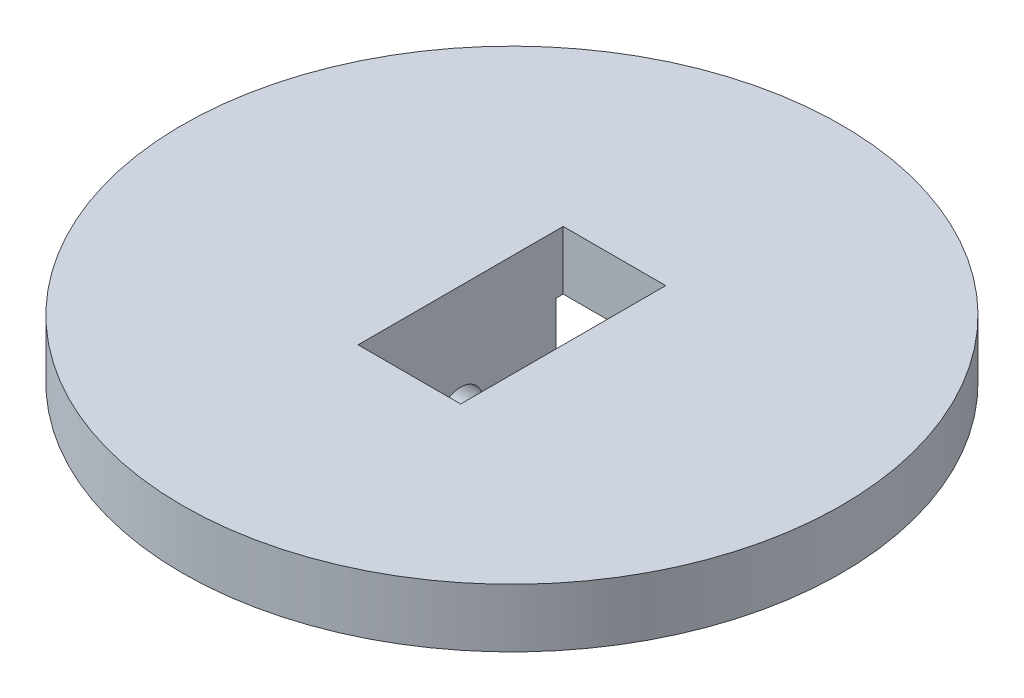
ISO-10303-21;
HEADER;
FILE_DESCRIPTION(('STEP AP214'),'2;1');
FILE_NAME('part.step','',(''),(''),'','','');
FILE_SCHEMA(('AUTOMOTIVE_DESIGN { 1 0 10303 214 1 1 1 1 }'));
ENDSEC;
DATA;
#1=APPLICATION_CONTEXT('core data for automotive mechanical design processes');
#2=APPLICATION_PROTOCOL_DEFINITION('international standard','automotive_design',2000,#1);
#3=PRODUCT_CONTEXT('',#1,'mechanical');
#4=PRODUCT('Part','Part','',(#3));
#5=PRODUCT_RELATED_PRODUCT_CATEGORY('part','',(#4));
#6=PRODUCT_DEFINITION_FORMATION('','',#4);
#7=PRODUCT_DEFINITION_CONTEXT('part definition',#1,'design');
#8=PRODUCT_DEFINITION('design','',#6,#7);
#9=PRODUCT_DEFINITION_SHAPE('','',#8);
#10=(LENGTH_UNIT() NAMED_UNIT(*) SI_UNIT(.MILLI.,.METRE.));
#11=(NAMED_UNIT(*) PLANE_ANGLE_UNIT() SI_UNIT($,.RADIAN.));
#12=(NAMED_UNIT(*) SI_UNIT($,.STERADIAN.) SOLID_ANGLE_UNIT());
#13=UNCERTAINTY_MEASURE_WITH_UNIT(LENGTH_MEASURE(1.E-05),#10,'distance_accuracy_value','');
#14=(GEOMETRIC_REPRESENTATION_CONTEXT(3) GLOBAL_UNCERTAINTY_ASSIGNED_CONTEXT((#13)) GLOBAL_UNIT_ASSIGNED_CONTEXT((#10,
#11,#12)) REPRESENTATION_CONTEXT('',''));
#15=CARTESIAN_POINT('',(0.,0.,0.));
#16=DIRECTION('',(0.,0.,1.));
#17=DIRECTION('',(1.,0.,0.));
#18=AXIS2_PLACEMENT_3D('',#15,#16,#17);
#19=CARTESIAN_POINT('',(0.,0.,6.5));
#20=DIRECTION('',(0.,0.,1.));
#21=DIRECTION('',(1.,0.,0.));
#22=AXIS2_PLACEMENT_3D('',#19,#20,#21);
#23=PLANE('',#22);
#24=DIRECTION('',(0.,-1.,0.));
#25=VECTOR('',#24,1.);
#26=CARTESIAN_POINT('',(-3.5,0.,6.5));
#27=LINE('',#26,#25);
#28=CARTESIAN_POINT('',(-3.5,0.,6.5));
#29=VERTEX_POINT('',#28);
#30=CARTESIAN_POINT('',(-3.5,-7.,6.5));
#31=VERTEX_POINT('',#30);
#32=EDGE_CURVE('E166',#29,#31,#27,.T.);
#33=ORIENTED_EDGE('',*,*,#32,.F.);
#34=DIRECTION('',(1.,0.,0.));
#35=VECTOR('',#34,1.);
#36=CARTESIAN_POINT('',(0.,0.,6.5));
#37=LINE('',#36,#35);
#38=CARTESIAN_POINT('',(-7.,0.,6.5));
#39=VERTEX_POINT('',#38);
#40=EDGE_CURVE('E210',#39,#29,#37,.T.);
#41=ORIENTED_EDGE('',*,*,#40,.F.);
#42=DIRECTION('',(0.,-1.,0.));
#43=VECTOR('',#42,1.);
#44=CARTESIAN_POINT('',(-7.,4.,6.5));
#45=LINE('',#44,#43);
#46=CARTESIAN_POINT('',(-7.,-7.,6.5));
#47=VERTEX_POINT('',#46);
#48=EDGE_CURVE('E169',#39,#47,#45,.T.);
#49=ORIENTED_EDGE('',*,*,#48,.T.);
#50=DIRECTION('',(1.,0.,0.));
#51=VECTOR('',#50,1.);
#52=CARTESIAN_POINT('',(-7.,-7.,6.5));
#53=LINE('',#52,#51);
#54=EDGE_CURVE('E173',#47,#31,#53,.T.);
#55=ORIENTED_EDGE('',*,*,#54,.T.);
#56=EDGE_LOOP('',(#33,#41,#49,#55));
#57=FACE_BOUND('',#56,.T.);
#58=ADVANCED_FACE('F33',(#57),#23,.T.);
#59=CARTESIAN_POINT('',(0.,0.,-6.5));
#60=DIRECTION('',(0.,0.,1.));
#61=DIRECTION('',(1.,0.,0.));
#62=AXIS2_PLACEMENT_3D('',#59,#60,#61);
#63=PLANE('',#62);
#64=DIRECTION('',(1.,0.,0.));
#65=VECTOR('',#64,1.);
#66=CARTESIAN_POINT('',(0.,0.,-6.5));
#67=LINE('',#66,#65);
#68=CARTESIAN_POINT('',(-7.,0.,-6.5));
#69=VERTEX_POINT('',#68);
#70=CARTESIAN_POINT('',(-3.5,0.,-6.5));
#71=VERTEX_POINT('',#70);
#72=EDGE_CURVE('E200',#69,#71,#67,.T.);
#73=ORIENTED_EDGE('',*,*,#72,.T.);
#74=DIRECTION('',(0.,-1.,0.));
#75=VECTOR('',#74,1.);
#76=CARTESIAN_POINT('',(-3.5,0.,-6.5));
#77=LINE('',#76,#75);
#78=CARTESIAN_POINT('',(-3.5,-7.,-6.5));
#79=VERTEX_POINT('',#78);
#80=EDGE_CURVE('E160',#71,#79,#77,.T.);
#81=ORIENTED_EDGE('',*,*,#80,.T.);
#82=DIRECTION('',(1.,0.,0.));
#83=VECTOR('',#82,1.);
#84=CARTESIAN_POINT('',(-7.,-7.,-6.5));
#85=LINE('',#84,#83);
#86=CARTESIAN_POINT('',(-7.,-7.,-6.5));
#87=VERTEX_POINT('',#86);
#88=EDGE_CURVE('E183',#87,#79,#85,.T.);
#89=ORIENTED_EDGE('',*,*,#88,.F.);
#90=DIRECTION('',(0.,-1.,0.));
#91=VECTOR('',#90,1.);
#92=CARTESIAN_POINT('',(-7.,4.,-6.5));
#93=LINE('',#92,#91);
#94=EDGE_CURVE('E180',#69,#87,#93,.T.);
#95=ORIENTED_EDGE('',*,*,#94,.F.);
#96=EDGE_LOOP('',(#73,#81,#89,#95));
#97=FACE_BOUND('',#96,.T.);
#98=ADVANCED_FACE('F235',(#97),#63,.F.);
#99=CARTESIAN_POINT('',(-7.,-7.,6.5));
#100=DIRECTION('',(0.,1.,0.));
#101=DIRECTION('',(0.,0.,1.));
#102=AXIS2_PLACEMENT_3D('',#99,#100,#101);
#103=PLANE('',#102);
#104=ORIENTED_EDGE('',*,*,#88,.T.);
#105=DIRECTION('',(0.,0.,1.));
#106=VECTOR('',#105,1.);
#107=CARTESIAN_POINT('',(-3.5,-7.,6.5));
#108=LINE('',#107,#106);
#109=EDGE_CURVE('E215',#79,#31,#108,.T.);
#110=ORIENTED_EDGE('',*,*,#109,.T.);
#111=ORIENTED_EDGE('',*,*,#54,.F.);
#112=DIRECTION('',(0.,0.,-1.));
#113=VECTOR('',#112,1.);
#114=CARTESIAN_POINT('',(-7.,-7.,6.5));
#115=LINE('',#114,#113);
#116=EDGE_CURVE('E190',#47,#87,#115,.T.);
#117=ORIENTED_EDGE('',*,*,#116,.T.);
#118=EDGE_LOOP('',(#104,#110,#111,#117));
#119=FACE_BOUND('',#118,.T.);
#120=ADVANCED_FACE('F237',(#119),#103,.F.);
#121=CARTESIAN_POINT('',(0.,4.,0.));
#122=DIRECTION('',(0.,-1.,0.));
#123=DIRECTION('',(0.,0.,-1.));
#124=AXIS2_PLACEMENT_3D('',#121,#122,#123);
#125=CYLINDRICAL_SURFACE('',#124,22.5);
#126=CARTESIAN_POINT('',(0.,4.,0.));
#127=DIRECTION('',(0.,1.,0.));
#128=DIRECTION('',(0.,0.,1.));
#129=AXIS2_PLACEMENT_3D('',#126,#127,#128);
#130=CIRCLE('',#129,22.5);
#131=CARTESIAN_POINT('',(0.,4.,22.5));
#132=VERTEX_POINT('',#131);
#133=EDGE_CURVE('E194',#132,#132,#130,.T.);
#134=ORIENTED_EDGE('',*,*,#133,.F.);
#135=EDGE_LOOP('',(#134));
#136=FACE_BOUND('',#135,.T.);
#137=CARTESIAN_POINT('',(0.,0.,0.));
#138=DIRECTION('',(0.,1.,0.));
#139=DIRECTION('',(0.,0.,1.));
#140=AXIS2_PLACEMENT_3D('',#137,#138,#139);
#141=CIRCLE('',#140,22.5);
#142=CARTESIAN_POINT('',(0.,0.,22.5));
#143=VERTEX_POINT('',#142);
#144=EDGE_CURVE('E193',#143,#143,#141,.T.);
#145=ORIENTED_EDGE('',*,*,#144,.T.);
#146=EDGE_LOOP('',(#145));
#147=FACE_BOUND('',#146,.T.);
#148=ADVANCED_FACE('F35',(#136,#147),#125,.T.);
#149=CARTESIAN_POINT('',(0.,4.,0.));
#150=DIRECTION('',(0.,1.,0.));
#151=DIRECTION('',(0.,0.,1.));
#152=AXIS2_PLACEMENT_3D('',#149,#150,#151);
#153=PLANE('',#152);
#154=DIRECTION('',(0.,0.,1.));
#155=VECTOR('',#154,1.);
#156=CARTESIAN_POINT('',(-3.5,4.,-7.));
#157=LINE('',#156,#155);
#158=CARTESIAN_POINT('',(-3.5,4.,-7.));
#159=VERTEX_POINT('',#158);
#160=CARTESIAN_POINT('',(-3.5,4.,7.));
#161=VERTEX_POINT('',#160);
#162=EDGE_CURVE('E49',#159,#161,#157,.T.);
#163=ORIENTED_EDGE('',*,*,#162,.F.);
#164=DIRECTION('',(-1.,0.,0.));
#165=VECTOR('',#164,1.);
#166=CARTESIAN_POINT('',(-3.5,4.,-7.));
#167=LINE('',#166,#165);
#168=CARTESIAN_POINT('',(3.5,4.,-7.));
#169=VERTEX_POINT('',#168);
#170=EDGE_CURVE('E145',#169,#159,#167,.T.);
#171=ORIENTED_EDGE('',*,*,#170,.F.);
#172=DIRECTION('',(0.,0.,-1.));
#173=VECTOR('',#172,1.);
#174=CARTESIAN_POINT('',(3.5,4.,-7.));
#175=LINE('',#174,#173);
#176=CARTESIAN_POINT('',(3.5,4.,7.));
#177=VERTEX_POINT('',#176);
#178=EDGE_CURVE('E128',#177,#169,#175,.T.);
#179=ORIENTED_EDGE('',*,*,#178,.F.);
#180=DIRECTION('',(1.,0.,0.));
#181=VECTOR('',#180,1.);
#182=CARTESIAN_POINT('',(-3.5,4.,7.));
#183=LINE('',#182,#181);
#184=EDGE_CURVE('E138',#161,#177,#183,.T.);
#185=ORIENTED_EDGE('',*,*,#184,.F.);
#186=EDGE_LOOP('',(#163,#171,#179,#185));
#187=FACE_BOUND('',#186,.T.);
#188=ORIENTED_EDGE('',*,*,#133,.T.);
#189=EDGE_LOOP('',(#188));
#190=FACE_BOUND('',#189,.T.);
#191=ADVANCED_FACE('F142',(#187,#190),#153,.T.);
#192=CARTESIAN_POINT('',(0.,0.,0.));
#193=DIRECTION('',(0.,1.,0.));
#194=DIRECTION('',(0.,0.,1.));
#195=AXIS2_PLACEMENT_3D('',#192,#193,#194);
#196=PLANE('',#195);
#197=DIRECTION('',(-1.,0.,0.));
#198=VECTOR('',#197,1.);
#199=CARTESIAN_POINT('',(0.,0.,-7.));
#200=LINE('',#199,#198);
#201=CARTESIAN_POINT('',(3.5,0.,-7.));
#202=VERTEX_POINT('',#201);
#203=CARTESIAN_POINT('',(-3.5,0.,-7.));
#204=VERTEX_POINT('',#203);
#205=EDGE_CURVE('E11',#202,#204,#200,.T.);
#206=ORIENTED_EDGE('',*,*,#205,.T.);
#207=DIRECTION('',(0.,0.,1.));
#208=VECTOR('',#207,1.);
#209=CARTESIAN_POINT('',(-3.5,0.,0.));
#210=LINE('',#209,#208);
#211=EDGE_CURVE('E163',#204,#71,#210,.T.);
#212=ORIENTED_EDGE('',*,*,#211,.T.);
#213=ORIENTED_EDGE('',*,*,#72,.F.);
#214=DIRECTION('',(0.,0.,-1.));
#215=VECTOR('',#214,1.);
#216=CARTESIAN_POINT('',(-7.,0.,0.));
#217=LINE('',#216,#215);
#218=EDGE_CURVE('E206',#39,#69,#217,.T.);
#219=ORIENTED_EDGE('',*,*,#218,.F.);
#220=ORIENTED_EDGE('',*,*,#40,.T.);
#221=CARTESIAN_POINT('',(-3.5,0.,7.));
#222=VERTEX_POINT('',#221);
#223=EDGE_CURVE('E167',#29,#222,#210,.T.);
#224=ORIENTED_EDGE('',*,*,#223,.T.);
#225=DIRECTION('',(1.,0.,0.));
#226=VECTOR('',#225,1.);
#227=CARTESIAN_POINT('',(0.,0.,7.));
#228=LINE('',#227,#226);
#229=CARTESIAN_POINT('',(3.5,0.,7.));
#230=VERTEX_POINT('',#229);
#231=EDGE_CURVE('E42',#222,#230,#228,.T.);
#232=ORIENTED_EDGE('',*,*,#231,.T.);
#233=DIRECTION('',(0.,0.,-1.));
#234=VECTOR('',#233,1.);
#235=CARTESIAN_POINT('',(3.5,0.,0.));
#236=LINE('',#235,#234);
#237=CARTESIAN_POINT('',(3.5,0.,6.5));
#238=VERTEX_POINT('',#237);
#239=EDGE_CURVE('E131',#230,#238,#236,.T.);
#240=ORIENTED_EDGE('',*,*,#239,.T.);
#241=CARTESIAN_POINT('',(7.,0.,6.5));
#242=VERTEX_POINT('',#241);
#243=EDGE_CURVE('E209',#238,#242,#37,.T.);
#244=ORIENTED_EDGE('',*,*,#243,.T.);
#245=DIRECTION('',(0.,0.,1.));
#246=VECTOR('',#245,1.);
#247=CARTESIAN_POINT('',(7.,0.,0.));
#248=LINE('',#247,#246);
#249=CARTESIAN_POINT('',(7.,0.,-6.5));
#250=VERTEX_POINT('',#249);
#251=EDGE_CURVE('E203',#250,#242,#248,.T.);
#252=ORIENTED_EDGE('',*,*,#251,.F.);
#253=CARTESIAN_POINT('',(3.5,0.,-6.5));
#254=VERTEX_POINT('',#253);
#255=EDGE_CURVE('E197',#254,#250,#67,.T.);
#256=ORIENTED_EDGE('',*,*,#255,.F.);
#257=EDGE_CURVE('E155',#254,#202,#236,.T.);
#258=ORIENTED_EDGE('',*,*,#257,.T.);
#259=EDGE_LOOP('',(#206,#212,#213,#219,#220,#224,#232,#240,#244,#252,#256,#258));
#260=FACE_BOUND('',#259,.T.);
#261=ORIENTED_EDGE('',*,*,#144,.F.);
#262=EDGE_LOOP('',(#261));
#263=FACE_BOUND('',#262,.T.);
#264=ADVANCED_FACE('F220',(#260,#263),#196,.F.);
#265=CARTESIAN_POINT('',(-7.,4.,6.5));
#266=DIRECTION('',(1.,0.,0.));
#267=DIRECTION('',(0.,1.,0.));
#268=AXIS2_PLACEMENT_3D('',#265,#266,#267);
#269=PLANE('',#268);
#270=CARTESIAN_POINT('',(-7.,-3.5,0.));
#271=DIRECTION('',(1.,0.,0.));
#272=DIRECTION('',(0.,1.,0.));
#273=AXIS2_PLACEMENT_3D('',#270,#271,#272);
#274=CIRCLE('',#273,1.5);
#275=CARTESIAN_POINT('',(-7.,-2.,0.));
#276=VERTEX_POINT('',#275);
#277=EDGE_CURVE('E405',#276,#276,#274,.T.);
#278=ORIENTED_EDGE('',*,*,#277,.T.);
#279=EDGE_LOOP('',(#278));
#280=FACE_BOUND('',#279,.T.);
#281=ORIENTED_EDGE('',*,*,#48,.F.);
#282=ORIENTED_EDGE('',*,*,#218,.T.);
#283=ORIENTED_EDGE('',*,*,#94,.T.);
#284=ORIENTED_EDGE('',*,*,#116,.F.);
#285=EDGE_LOOP('',(#281,#282,#283,#284));
#286=FACE_BOUND('',#285,.T.);
#287=ADVANCED_FACE('F231',(#280,#286),#269,.F.);
#288=CARTESIAN_POINT('',(7.,4.,6.5));
#289=DIRECTION('',(-1.,0.,0.));
#290=DIRECTION('',(0.,-1.,0.));
#291=AXIS2_PLACEMENT_3D('',#288,#289,#290);
#292=PLANE('',#291);
#293=CARTESIAN_POINT('',(7.,-3.5,0.));
#294=DIRECTION('',(-1.,0.,0.));
#295=DIRECTION('',(0.,-1.,0.));
#296=AXIS2_PLACEMENT_3D('',#293,#294,#295);
#297=CIRCLE('',#296,1.5);
#298=CARTESIAN_POINT('',(7.,-5.,0.));
#299=VERTEX_POINT('',#298);
#300=EDGE_CURVE('E406',#299,#299,#297,.T.);
#301=ORIENTED_EDGE('',*,*,#300,.T.);
#302=EDGE_LOOP('',(#301));
#303=FACE_BOUND('',#302,.T.);
#304=DIRECTION('',(0.,1.,0.));
#305=VECTOR('',#304,1.);
#306=CARTESIAN_POINT('',(7.,4.,-6.5));
#307=LINE('',#306,#305);
#308=CARTESIAN_POINT('',(7.,-7.,-6.5));
#309=VERTEX_POINT('',#308);
#310=EDGE_CURVE('E172',#309,#250,#307,.T.);
#311=ORIENTED_EDGE('',*,*,#310,.T.);
#312=ORIENTED_EDGE('',*,*,#251,.T.);
#313=DIRECTION('',(0.,1.,0.));
#314=VECTOR('',#313,1.);
#315=CARTESIAN_POINT('',(7.,4.,6.5));
#316=LINE('',#315,#314);
#317=CARTESIAN_POINT('',(7.,-7.,6.5));
#318=VERTEX_POINT('',#317);
#319=EDGE_CURVE('E176',#318,#242,#316,.T.);
#320=ORIENTED_EDGE('',*,*,#319,.F.);
#321=DIRECTION('',(0.,0.,-1.));
#322=VECTOR('',#321,1.);
#323=CARTESIAN_POINT('',(7.,-7.,6.5));
#324=LINE('',#323,#322);
#325=EDGE_CURVE('E179',#318,#309,#324,.T.);
#326=ORIENTED_EDGE('',*,*,#325,.T.);
#327=EDGE_LOOP('',(#311,#312,#320,#326));
#328=FACE_BOUND('',#327,.T.);
#329=ADVANCED_FACE('F249',(#303,#328),#292,.F.);
#330=DIRECTION('',(0.,1.,0.));
#331=VECTOR('',#330,1.);
#332=CARTESIAN_POINT('',(3.5,0.,6.5));
#333=LINE('',#332,#331);
#334=CARTESIAN_POINT('',(3.5,-7.,6.5));
#335=VERTEX_POINT('',#334);
#336=EDGE_CURVE('E158',#335,#238,#333,.T.);
#337=ORIENTED_EDGE('',*,*,#336,.F.);
#338=EDGE_CURVE('E171',#335,#318,#53,.T.);
#339=ORIENTED_EDGE('',*,*,#338,.T.);
#340=ORIENTED_EDGE('',*,*,#319,.T.);
#341=ORIENTED_EDGE('',*,*,#243,.F.);
#342=EDGE_LOOP('',(#337,#339,#340,#341));
#343=FACE_BOUND('',#342,.T.);
#344=ADVANCED_FACE('F256',(#343),#23,.T.);
#345=CARTESIAN_POINT('',(3.5,-7.,-6.5));
#346=VERTEX_POINT('',#345);
#347=EDGE_CURVE('E182',#346,#309,#85,.T.);
#348=ORIENTED_EDGE('',*,*,#347,.F.);
#349=DIRECTION('',(0.,1.,0.));
#350=VECTOR('',#349,1.);
#351=CARTESIAN_POINT('',(3.5,0.,-6.5));
#352=LINE('',#351,#350);
#353=EDGE_CURVE('E57',#346,#254,#352,.T.);
#354=ORIENTED_EDGE('',*,*,#353,.T.);
#355=ORIENTED_EDGE('',*,*,#255,.T.);
#356=ORIENTED_EDGE('',*,*,#310,.F.);
#357=EDGE_LOOP('',(#348,#354,#355,#356));
#358=FACE_BOUND('',#357,.T.);
#359=ADVANCED_FACE('F244',(#358),#63,.F.);
#360=ORIENTED_EDGE('',*,*,#338,.F.);
#361=DIRECTION('',(0.,0.,-1.));
#362=VECTOR('',#361,1.);
#363=CARTESIAN_POINT('',(3.5,-7.,6.5));
#364=LINE('',#363,#362);
#365=EDGE_CURVE('E213',#335,#346,#364,.T.);
#366=ORIENTED_EDGE('',*,*,#365,.T.);
#367=ORIENTED_EDGE('',*,*,#347,.T.);
#368=ORIENTED_EDGE('',*,*,#325,.F.);
#369=EDGE_LOOP('',(#360,#366,#367,#368));
#370=FACE_BOUND('',#369,.T.);
#371=ADVANCED_FACE('F253',(#370),#103,.F.);
#372=CARTESIAN_POINT('',(-3.5,-7.,-7.));
#373=DIRECTION('',(0.,0.,-1.));
#374=DIRECTION('',(-1.,0.,0.));
#375=AXIS2_PLACEMENT_3D('',#372,#373,#374);
#376=PLANE('',#375);
#377=DIRECTION('',(0.,1.,0.));
#378=VECTOR('',#377,1.);
#379=CARTESIAN_POINT('',(3.5,-7.,-7.));
#380=LINE('',#379,#378);
#381=EDGE_CURVE('E134',#202,#169,#380,.T.);
#382=ORIENTED_EDGE('',*,*,#381,.T.);
#383=ORIENTED_EDGE('',*,*,#170,.T.);
#384=DIRECTION('',(0.,1.,0.));
#385=VECTOR('',#384,1.);
#386=CARTESIAN_POINT('',(-3.5,-7.,-7.));
#387=LINE('',#386,#385);
#388=EDGE_CURVE('E150',#204,#159,#387,.T.);
#389=ORIENTED_EDGE('',*,*,#388,.F.);
#390=ORIENTED_EDGE('',*,*,#205,.F.);
#391=EDGE_LOOP('',(#382,#383,#389,#390));
#392=FACE_BOUND('',#391,.T.);
#393=ADVANCED_FACE('F241',(#392),#376,.F.);
#394=CARTESIAN_POINT('',(-3.5,-7.,7.));
#395=DIRECTION('',(0.,0.,1.));
#396=DIRECTION('',(1.,0.,0.));
#397=AXIS2_PLACEMENT_3D('',#394,#395,#396);
#398=PLANE('',#397);
#399=DIRECTION('',(0.,1.,0.));
#400=VECTOR('',#399,1.);
#401=CARTESIAN_POINT('',(-3.5,-7.,7.));
#402=LINE('',#401,#400);
#403=EDGE_CURVE('E135',#222,#161,#402,.T.);
#404=ORIENTED_EDGE('',*,*,#403,.T.);
#405=ORIENTED_EDGE('',*,*,#184,.T.);
#406=DIRECTION('',(0.,1.,0.));
#407=VECTOR('',#406,1.);
#408=CARTESIAN_POINT('',(3.5,-7.,7.));
#409=LINE('',#408,#407);
#410=EDGE_CURVE('E123',#230,#177,#409,.T.);
#411=ORIENTED_EDGE('',*,*,#410,.F.);
#412=ORIENTED_EDGE('',*,*,#231,.F.);
#413=EDGE_LOOP('',(#404,#405,#411,#412));
#414=FACE_BOUND('',#413,.T.);
#415=ADVANCED_FACE('F139',(#414),#398,.F.);
#416=CARTESIAN_POINT('',(-3.5,-7.,-7.));
#417=DIRECTION('',(-1.,0.,0.));
#418=DIRECTION('',(0.,0.,1.));
#419=AXIS2_PLACEMENT_3D('',#416,#417,#418);
#420=PLANE('',#419);
#421=CARTESIAN_POINT('',(-3.5,-3.5,0.));
#422=DIRECTION('',(-1.,0.,0.));
#423=DIRECTION('',(0.,0.,1.));
#424=AXIS2_PLACEMENT_3D('',#421,#422,#423);
#425=CIRCLE('',#424,1.5);
#426=CARTESIAN_POINT('',(-3.5,-3.5,1.5));
#427=VERTEX_POINT('',#426);
#428=EDGE_CURVE('E402',#427,#427,#425,.T.);
#429=ORIENTED_EDGE('',*,*,#428,.T.);
#430=EDGE_LOOP('',(#429));
#431=FACE_BOUND('',#430,.T.);
#432=ORIENTED_EDGE('',*,*,#32,.T.);
#433=ORIENTED_EDGE('',*,*,#109,.F.);
#434=ORIENTED_EDGE('',*,*,#80,.F.);
#435=ORIENTED_EDGE('',*,*,#211,.F.);
#436=ORIENTED_EDGE('',*,*,#388,.T.);
#437=ORIENTED_EDGE('',*,*,#162,.T.);
#438=ORIENTED_EDGE('',*,*,#403,.F.);
#439=ORIENTED_EDGE('',*,*,#223,.F.);
#440=EDGE_LOOP('',(#432,#433,#434,#435,#436,#437,#438,#439));
#441=FACE_BOUND('',#440,.T.);
#442=ADVANCED_FACE('F223',(#431,#441),#420,.F.);
#443=CARTESIAN_POINT('',(3.5,-7.,-7.));
#444=DIRECTION('',(1.,0.,0.));
#445=DIRECTION('',(0.,0.,-1.));
#446=AXIS2_PLACEMENT_3D('',#443,#444,#445);
#447=PLANE('',#446);
#448=CARTESIAN_POINT('',(3.5,-3.5,0.));
#449=DIRECTION('',(1.,0.,0.));
#450=DIRECTION('',(0.,0.,-1.));
#451=AXIS2_PLACEMENT_3D('',#448,#449,#450);
#452=CIRCLE('',#451,1.5);
#453=CARTESIAN_POINT('',(3.5,-3.5,-1.5));
#454=VERTEX_POINT('',#453);
#455=EDGE_CURVE('E37',#454,#454,#452,.T.);
#456=ORIENTED_EDGE('',*,*,#455,.T.);
#457=EDGE_LOOP('',(#456));
#458=FACE_BOUND('',#457,.T.);
#459=ORIENTED_EDGE('',*,*,#410,.T.);
#460=ORIENTED_EDGE('',*,*,#178,.T.);
#461=ORIENTED_EDGE('',*,*,#381,.F.);
#462=ORIENTED_EDGE('',*,*,#257,.F.);
#463=ORIENTED_EDGE('',*,*,#353,.F.);
#464=ORIENTED_EDGE('',*,*,#365,.F.);
#465=ORIENTED_EDGE('',*,*,#336,.T.);
#466=ORIENTED_EDGE('',*,*,#239,.F.);
#467=EDGE_LOOP('',(#459,#460,#461,#462,#463,#464,#465,#466));
#468=FACE_BOUND('',#467,.T.);
#469=ADVANCED_FACE('F125',(#458,#468),#447,.F.);
#470=CARTESIAN_POINT('',(-22.5,-3.5,0.));
#471=DIRECTION('',(1.,0.,0.));
#472=DIRECTION('',(0.,0.,-1.));
#473=AXIS2_PLACEMENT_3D('',#470,#471,#472);
#474=CYLINDRICAL_SURFACE('',#473,1.5);
#475=ORIENTED_EDGE('',*,*,#455,.F.);
#476=EDGE_LOOP('',(#475));
#477=FACE_BOUND('',#476,.T.);
#478=ORIENTED_EDGE('',*,*,#300,.F.);
#479=EDGE_LOOP('',(#478));
#480=FACE_BOUND('',#479,.T.);
#481=ADVANCED_FACE('F316',(#477,#480),#474,.F.);
#482=ORIENTED_EDGE('',*,*,#428,.F.);
#483=EDGE_LOOP('',(#482));
#484=FACE_BOUND('',#483,.T.);
#485=ORIENTED_EDGE('',*,*,#277,.F.);
#486=EDGE_LOOP('',(#485));
#487=FACE_BOUND('',#486,.T.);
#488=ADVANCED_FACE('F326',(#484,#487),#474,.F.);
#489=CLOSED_SHELL('',(#58,#98,#120,#148,#191,#264,#287,#329,#344,#359,#371,#393,#415,#442,#469,
#481,#488));
#490=MANIFOLD_SOLID_BREP('B2',#489);
#491=ADVANCED_BREP_SHAPE_REPRESENTATION('',(#18,#490),#14);
#492=SHAPE_DEFINITION_REPRESENTATION(#9,#491);
ENDSEC;
END-ISO-10303-21;
